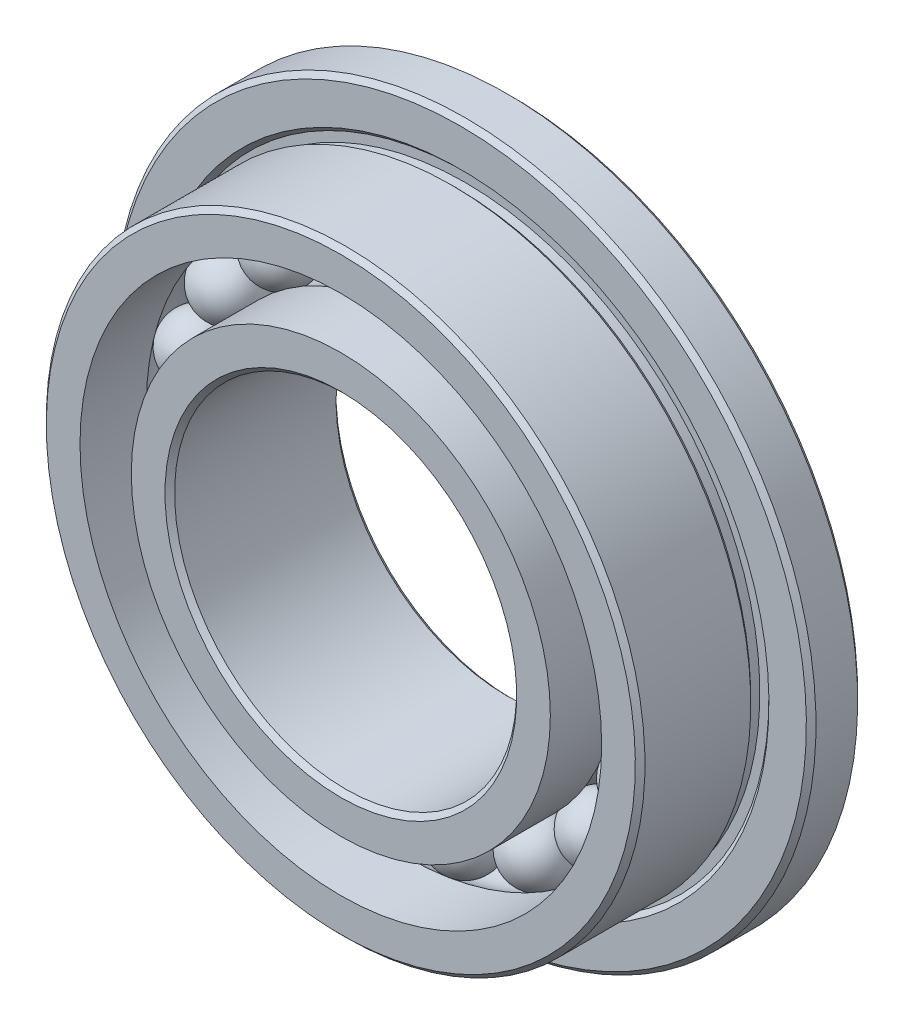
ISO-10303-21;
HEADER;
FILE_DESCRIPTION(('STEP AP214'),'2;1');
FILE_NAME('part.step','',(''),(''),'','','');
FILE_SCHEMA(('AUTOMOTIVE_DESIGN { 1 0 10303 214 1 1 1 1 }'));
ENDSEC;
DATA;
#1=APPLICATION_CONTEXT('core data for automotive mechanical design processes');
#2=APPLICATION_PROTOCOL_DEFINITION('international standard','automotive_design',2000,#1);
#3=PRODUCT_CONTEXT('',#1,'mechanical');
#4=PRODUCT('Part','Part','',(#3));
#5=PRODUCT_RELATED_PRODUCT_CATEGORY('part','',(#4));
#6=PRODUCT_DEFINITION_FORMATION('','',#4);
#7=PRODUCT_DEFINITION_CONTEXT('part definition',#1,'design');
#8=PRODUCT_DEFINITION('design','',#6,#7);
#9=PRODUCT_DEFINITION_SHAPE('','',#8);
#10=(LENGTH_UNIT() NAMED_UNIT(*) SI_UNIT(.MILLI.,.METRE.));
#11=(NAMED_UNIT(*) PLANE_ANGLE_UNIT() SI_UNIT($,.RADIAN.));
#12=(NAMED_UNIT(*) SI_UNIT($,.STERADIAN.) SOLID_ANGLE_UNIT());
#13=UNCERTAINTY_MEASURE_WITH_UNIT(LENGTH_MEASURE(1.E-05),#10,'distance_accuracy_value','');
#14=(GEOMETRIC_REPRESENTATION_CONTEXT(3) GLOBAL_UNCERTAINTY_ASSIGNED_CONTEXT((#13)) GLOBAL_UNIT_ASSIGNED_CONTEXT((#10,
#11,#12)) REPRESENTATION_CONTEXT('',''));
#15=CARTESIAN_POINT('',(0.,0.,0.));
#16=DIRECTION('',(0.,0.,1.));
#17=DIRECTION('',(1.,0.,0.));
#18=AXIS2_PLACEMENT_3D('',#15,#16,#17);
#19=CARTESIAN_POINT('',(-0.892923540312843,2.60099741467676,0.));
#20=DIRECTION('',(-0.324699469204671,0.945817241700639,0.));
#21=DIRECTION('',(0.945817241700639,0.324699469204671,0.));
#22=AXIS2_PLACEMENT_3D('',#19,#20,#21);
#23=SPHERICAL_SURFACE('',#22,0.374999999999999);
#24=CARTESIAN_POINT('',(-1.01468584126459,2.9556788803145,0.));
#25=VERTEX_POINT('',#24);
#26=VERTEX_LOOP('',#25);
#27=FACE_BOUND('',#26,.T.);
#28=ADVANCED_FACE('F52',(#27),#23,.T.);
#29=CLOSED_SHELL('',(#28));
#30=MANIFOLD_SOLID_BREP('B2',#29);
#31=CARTESIAN_POINT('',(-1.68908495989656,2.1701364008401,0.));
#32=DIRECTION('',(-0.614212712689658,0.789140509396402,0.));
#33=DIRECTION('',(0.789140509396402,0.614212712689658,0.));
#34=AXIS2_PLACEMENT_3D('',#31,#32,#33);
#35=SPHERICAL_SURFACE('',#34,0.374999999999999);
#36=CARTESIAN_POINT('',(-1.91941472715518,2.46606409186376,0.));
#37=VERTEX_POINT('',#36);
#38=VERTEX_LOOP('',#37);
#39=FACE_BOUND('',#38,.T.);
#40=ADVANCED_FACE('F71',(#39),#35,.T.);
#41=CLOSED_SHELL('',(#40));
#42=MANIFOLD_SOLID_BREP('B7',#41);
#43=CARTESIAN_POINT('',(-2.30220781522194,1.5041074348367,0.));
#44=DIRECTION('',(-0.837166478262522,0.546948158122437,0.));
#45=DIRECTION('',(0.546948158122437,0.837166478262522,0.));
#46=AXIS2_PLACEMENT_3D('',#43,#44,#45);
#47=SPHERICAL_SURFACE('',#46,0.374999999999999);
#48=CARTESIAN_POINT('',(-2.61614524457038,1.70921299413262,0.));
#49=VERTEX_POINT('',#48);
#50=VERTEX_LOOP('',#49);
#51=FACE_BOUND('',#50,.T.);
#52=ADVANCED_FACE('F90',(#51),#47,.T.);
#53=CLOSED_SHELL('',(#52));
#54=MANIFOLD_SOLID_BREP('B48',#53);
#55=CARTESIAN_POINT('',(-2.66585073133315,0.675085089637227,0.));
#56=DIRECTION('',(-0.969400265939328,0.24548548714081,0.));
#57=DIRECTION('',(0.24548548714081,0.969400265939328,0.));
#58=AXIS2_PLACEMENT_3D('',#55,#56,#57);
#59=SPHERICAL_SURFACE('',#58,0.374999999999999);
#60=CARTESIAN_POINT('',(-3.0293758310604,0.767142147315031,0.));
#61=VERTEX_POINT('',#60);
#62=VERTEX_LOOP('',#61);
#63=FACE_BOUND('',#62,.T.);
#64=ADVANCED_FACE('F109',(#63),#59,.T.);
#65=CLOSED_SHELL('',(#64));
#66=MANIFOLD_SOLID_BREP('B67',#65);
#67=CARTESIAN_POINT('',(-2.74060735576834,-0.227093200048886,0.));
#68=DIRECTION('',(-0.996584493006671,-0.0825793454723223,0.));
#69=DIRECTION('',(-0.0825793454723223,0.996584493006671,0.));
#70=AXIS2_PLACEMENT_3D('',#67,#68,#69);
#71=SPHERICAL_SURFACE('',#70,0.374999999999999);
#72=CARTESIAN_POINT('',(-3.11432654064585,-0.258060454601007,0.));
#73=VERTEX_POINT('',#72);
#74=VERTEX_LOOP('',#73);
#75=FACE_BOUND('',#74,.T.);
#76=ADVANCED_FACE('F128',(#75),#71,.T.);
#77=CLOSED_SHELL('',(#76));
#78=MANIFOLD_SOLID_BREP('B86',#77);
#79=CARTESIAN_POINT('',(-2.51837664830142,-1.10466241779564,0.));
#80=DIRECTION('',(-0.915773326655062,-0.40169542465296,0.));
#81=DIRECTION('',(-0.40169542465296,0.915773326655062,0.));
#82=AXIS2_PLACEMENT_3D('',#79,#80,#81);
#83=SPHERICAL_SURFACE('',#82,0.374999999999999);
#84=CARTESIAN_POINT('',(-2.86179164579707,-1.2552982020405,0.));
#85=VERTEX_POINT('',#84);
#86=VERTEX_LOOP('',#85);
#87=FACE_BOUND('',#86,.T.);
#88=ADVANCED_FACE('F147',(#87),#83,.T.);
#89=CLOSED_SHELL('',(#88));
#90=MANIFOLD_SOLID_BREP('B105',#89);
#91=CARTESIAN_POINT('',(-2.02324075435113,-1.86252432197077,0.));
#92=DIRECTION('',(-0.735723910673138,-0.677281571625734,0.));
#93=DIRECTION('',(-0.677281571625734,0.735723910673138,0.));
#94=AXIS2_PLACEMENT_3D('',#91,#92,#93);
#95=SPHERICAL_SURFACE('',#94,0.374999999999999);
#96=CARTESIAN_POINT('',(-2.29913722085356,-2.11650491133042,0.));
#97=VERTEX_POINT('',#96);
#98=VERTEX_LOOP('',#97);
#99=FACE_BOUND('',#98,.T.);
#100=ADVANCED_FACE('F166',(#99),#95,.T.);
#101=CLOSED_SHELL('',(#100));
#102=MANIFOLD_SOLID_BREP('B124',#101);
#103=CARTESIAN_POINT('',(-1.30885533085197,-2.41855281581783,0.));
#104=DIRECTION('',(-0.475947393037081,-0.879473751206485,0.));
#105=DIRECTION('',(-0.879473751206485,0.475947393037081,0.));
#106=AXIS2_PLACEMENT_3D('',#103,#104,#105);
#107=SPHERICAL_SURFACE('',#106,0.374999999999999);
#108=CARTESIAN_POINT('',(-1.48733560324088,-2.74835547252027,0.));
#109=VERTEX_POINT('',#108);
#110=VERTEX_LOOP('',#109);
#111=FACE_BOUND('',#110,.T.);
#112=ADVANCED_FACE('F185',(#111),#107,.T.);
#113=CLOSED_SHELL('',(#112));
#114=MANIFOLD_SOLID_BREP('B143',#113);
#115=CARTESIAN_POINT('',(-0.452635123272038,-2.71249358435748,0.));
#116=DIRECTION('',(-0.164594590280741,-0.986361303402721,0.));
#117=DIRECTION('',(-0.986361303402721,0.164594590280741,0.));
#118=AXIS2_PLACEMENT_3D('',#115,#116,#117);
#119=SPHERICAL_SURFACE('',#118,0.374999999999999);
#120=CARTESIAN_POINT('',(-0.514358094627316,-3.0823790731335,0.));
#121=VERTEX_POINT('',#120);
#122=VERTEX_LOOP('',#121);
#123=FACE_BOUND('',#122,.T.);
#124=ADVANCED_FACE('F204',(#123),#119,.T.);
#125=CLOSED_SHELL('',(#124));
#126=MANIFOLD_SOLID_BREP('B162',#125);
#127=CARTESIAN_POINT('',(0.452635123271999,-2.71249358435749,0.));
#128=DIRECTION('',(0.164594590280727,-0.986361303402724,0.));
#129=DIRECTION('',(-0.986361303402724,-0.164594590280727,0.));
#130=AXIS2_PLACEMENT_3D('',#127,#128,#129);
#131=SPHERICAL_SURFACE('',#130,0.374999999999999);
#132=CARTESIAN_POINT('',(0.514358094627272,-3.08237907313351,0.));
#133=VERTEX_POINT('',#132);
#134=VERTEX_LOOP('',#133);
#135=FACE_BOUND('',#134,.T.);
#136=ADVANCED_FACE('F223',(#135),#131,.T.);
#137=CLOSED_SHELL('',(#136));
#138=MANIFOLD_SOLID_BREP('B181',#137);
#139=CARTESIAN_POINT('',(1.30885533085194,-2.41855281581785,0.));
#140=DIRECTION('',(0.475947393037068,-0.879473751206492,0.));
#141=DIRECTION('',(-0.879473751206492,-0.475947393037068,0.));
#142=AXIS2_PLACEMENT_3D('',#139,#140,#141);
#143=SPHERICAL_SURFACE('',#142,0.374999999999999);
#144=CARTESIAN_POINT('',(1.48733560324084,-2.74835547252029,0.));
#145=VERTEX_POINT('',#144);
#146=VERTEX_LOOP('',#145);
#147=FACE_BOUND('',#146,.T.);
#148=ADVANCED_FACE('F242',(#147),#143,.T.);
#149=CLOSED_SHELL('',(#148));
#150=MANIFOLD_SOLID_BREP('B200',#149);
#151=CARTESIAN_POINT('',(2.0232407543511,-1.8625243219708,0.));
#152=DIRECTION('',(0.735723910673128,-0.677281571625745,0.));
#153=DIRECTION('',(-0.677281571625745,-0.735723910673128,0.));
#154=AXIS2_PLACEMENT_3D('',#151,#152,#153);
#155=SPHERICAL_SURFACE('',#154,0.374999999999999);
#156=CARTESIAN_POINT('',(2.29913722085353,-2.11650491133045,0.));
#157=VERTEX_POINT('',#156);
#158=VERTEX_LOOP('',#157);
#159=FACE_BOUND('',#158,.T.);
#160=ADVANCED_FACE('F261',(#159),#155,.T.);
#161=CLOSED_SHELL('',(#160));
#162=MANIFOLD_SOLID_BREP('B219',#161);
#163=CARTESIAN_POINT('',(2.5183766483014,-1.10466241779568,0.));
#164=DIRECTION('',(0.915773326655056,-0.401695424652974,0.));
#165=DIRECTION('',(-0.401695424652974,-0.915773326655056,0.));
#166=AXIS2_PLACEMENT_3D('',#163,#164,#165);
#167=SPHERICAL_SURFACE('',#166,0.374999999999999);
#168=CARTESIAN_POINT('',(2.86179164579705,-1.25529820204054,0.));
#169=VERTEX_POINT('',#168);
#170=VERTEX_LOOP('',#169);
#171=FACE_BOUND('',#170,.T.);
#172=ADVANCED_FACE('F280',(#171),#167,.T.);
#173=CLOSED_SHELL('',(#172));
#174=MANIFOLD_SOLID_BREP('B238',#173);
#175=CARTESIAN_POINT('',(2.74060735576834,-0.227093200048924,0.));
#176=DIRECTION('',(0.99658449300667,-0.0825793454723359,0.));
#177=DIRECTION('',(-0.0825793454723359,-0.99658449300667,0.));
#178=AXIS2_PLACEMENT_3D('',#175,#176,#177);
#179=SPHERICAL_SURFACE('',#178,0.374999999999999);
#180=CARTESIAN_POINT('',(3.11432654064584,-0.25806045460105,0.));
#181=VERTEX_POINT('',#180);
#182=VERTEX_LOOP('',#181);
#183=FACE_BOUND('',#182,.T.);
#184=ADVANCED_FACE('F299',(#183),#179,.T.);
#185=CLOSED_SHELL('',(#184));
#186=MANIFOLD_SOLID_BREP('B257',#185);
#187=CARTESIAN_POINT('',(2.66585073133316,0.67508508963719,0.));
#188=DIRECTION('',(0.969400265939331,0.245485487140796,0.));
#189=DIRECTION('',(0.245485487140796,-0.969400265939331,0.));
#190=AXIS2_PLACEMENT_3D('',#187,#188,#189);
#191=SPHERICAL_SURFACE('',#190,0.374999999999999);
#192=CARTESIAN_POINT('',(3.02937583106041,0.767142147314988,0.));
#193=VERTEX_POINT('',#192);
#194=VERTEX_LOOP('',#193);
#195=FACE_BOUND('',#194,.T.);
#196=ADVANCED_FACE('F318',(#195),#191,.T.);
#197=CLOSED_SHELL('',(#196));
#198=MANIFOLD_SOLID_BREP('B276',#197);
#199=CARTESIAN_POINT('',(2.30220781522196,1.50410743483667,0.));
#200=DIRECTION('',(0.83716647826253,0.546948158122425,0.));
#201=DIRECTION('',(0.546948158122425,-0.83716647826253,0.));
#202=AXIS2_PLACEMENT_3D('',#199,#200,#201);
#203=SPHERICAL_SURFACE('',#202,0.374999999999999);
#204=CARTESIAN_POINT('',(2.61614524457041,1.70921299413258,0.));
#205=VERTEX_POINT('',#204);
#206=VERTEX_LOOP('',#205);
#207=FACE_BOUND('',#206,.T.);
#208=ADVANCED_FACE('F337',(#207),#203,.T.);
#209=CLOSED_SHELL('',(#208));
#210=MANIFOLD_SOLID_BREP('B295',#209);
#211=CARTESIAN_POINT('',(1.68908495989659,2.17013640084008,0.));
#212=DIRECTION('',(0.614212712689669,0.789140509396393,0.));
#213=DIRECTION('',(0.789140509396393,-0.614212712689669,0.));
#214=AXIS2_PLACEMENT_3D('',#211,#212,#213);
#215=SPHERICAL_SURFACE('',#214,0.374999999999999);
#216=CARTESIAN_POINT('',(1.91941472715522,2.46606409186373,0.));
#217=VERTEX_POINT('',#216);
#218=VERTEX_LOOP('',#217);
#219=FACE_BOUND('',#218,.T.);
#220=ADVANCED_FACE('F356',(#219),#215,.T.);
#221=CLOSED_SHELL('',(#220));
#222=MANIFOLD_SOLID_BREP('B314',#221);
#223=CARTESIAN_POINT('',(0.892923540312882,2.60099741467674,0.));
#224=DIRECTION('',(0.324699469204684,0.945817241700635,0.));
#225=DIRECTION('',(0.945817241700635,-0.324699469204684,0.));
#226=AXIS2_PLACEMENT_3D('',#223,#224,#225);
#227=SPHERICAL_SURFACE('',#226,0.374999999999999);
#228=CARTESIAN_POINT('',(1.01468584126464,2.95567888031448,0.));
#229=VERTEX_POINT('',#228);
#230=VERTEX_LOOP('',#229);
#231=FACE_BOUND('',#230,.T.);
#232=ADVANCED_FACE('F375',(#231),#227,.T.);
#233=CLOSED_SHELL('',(#232));
#234=MANIFOLD_SOLID_BREP('B333',#233);
#235=CARTESIAN_POINT('',(0.,2.75,0.));
#236=DIRECTION('',(0.,1.,0.));
#237=DIRECTION('',(1.,0.,0.));
#238=AXIS2_PLACEMENT_3D('',#235,#236,#237);
#239=SPHERICAL_SURFACE('',#238,0.374999999999999);
#240=CARTESIAN_POINT('',(0.,3.125,0.));
#241=VERTEX_POINT('',#240);
#242=VERTEX_LOOP('',#241);
#243=FACE_BOUND('',#242,.T.);
#244=ADVANCED_FACE('F397',(#243),#239,.T.);
#245=CLOSED_SHELL('',(#244));
#246=MANIFOLD_SOLID_BREP('B352',#245);
#247=CARTESIAN_POINT('',(0.,0.,0.));
#248=DIRECTION('',(0.,0.,1.));
#249=DIRECTION('',(0.,-1.,0.));
#250=AXIS2_PLACEMENT_3D('',#247,#248,#249);
#251=CYLINDRICAL_SURFACE('',#250,2.45);
#252=CARTESIAN_POINT('',(0.,0.,-0.225));
#253=DIRECTION('',(0.,0.,1.));
#254=DIRECTION('',(0.,-1.,0.));
#255=AXIS2_PLACEMENT_3D('',#252,#253,#254);
#256=CIRCLE('',#255,2.45);
#257=CARTESIAN_POINT('',(0.,-2.45,-0.225));
#258=VERTEX_POINT('',#257);
#259=EDGE_CURVE('E437',#258,#258,#256,.T.);
#260=ORIENTED_EDGE('',*,*,#259,.F.);
#261=EDGE_LOOP('',(#260));
#262=FACE_BOUND('',#261,.T.);
#263=CARTESIAN_POINT('',(0.,0.,-1.));
#264=DIRECTION('',(0.,0.,1.));
#265=DIRECTION('',(0.,-1.,0.));
#266=AXIS2_PLACEMENT_3D('',#263,#264,#265);
#267=CIRCLE('',#266,2.45);
#268=CARTESIAN_POINT('',(0.,-2.45,-1.));
#269=VERTEX_POINT('',#268);
#270=EDGE_CURVE('E446',#269,#269,#267,.T.);
#271=ORIENTED_EDGE('',*,*,#270,.T.);
#272=EDGE_LOOP('',(#271));
#273=FACE_BOUND('',#272,.T.);
#274=ADVANCED_FACE('F417',(#262,#273),#251,.T.);
#275=CARTESIAN_POINT('',(0.,0.,0.));
#276=DIRECTION('',(0.,0.,1.));
#277=DIRECTION('',(0.,-1.,0.));
#278=AXIS2_PLACEMENT_3D('',#275,#276,#277);
#279=TOROIDAL_SURFACE('',#278,2.75,0.375);
#280=CARTESIAN_POINT('',(0.,0.,0.225));
#281=DIRECTION('',(0.,0.,1.));
#282=DIRECTION('',(0.,-1.,0.));
#283=AXIS2_PLACEMENT_3D('',#280,#281,#282);
#284=CIRCLE('',#283,2.45);
#285=CARTESIAN_POINT('',(0.,-2.45,0.225));
#286=VERTEX_POINT('',#285);
#287=EDGE_CURVE('E440',#286,#286,#284,.T.);
#288=ORIENTED_EDGE('',*,*,#287,.F.);
#289=EDGE_LOOP('',(#288));
#290=FACE_BOUND('',#289,.T.);
#291=ORIENTED_EDGE('',*,*,#259,.T.);
#292=EDGE_LOOP('',(#291));
#293=FACE_BOUND('',#292,.T.);
#294=ADVANCED_FACE('F465',(#290,#293),#279,.F.);
#295=CARTESIAN_POINT('',(0.,0.,0.));
#296=DIRECTION('',(0.,0.,1.));
#297=DIRECTION('',(0.,-1.,0.));
#298=AXIS2_PLACEMENT_3D('',#295,#296,#297);
#299=CYLINDRICAL_SURFACE('',#298,2.45);
#300=CARTESIAN_POINT('',(0.,0.,1.));
#301=DIRECTION('',(0.,0.,1.));
#302=DIRECTION('',(0.,-1.,0.));
#303=AXIS2_PLACEMENT_3D('',#300,#301,#302);
#304=CIRCLE('',#303,2.45);
#305=CARTESIAN_POINT('',(0.,-2.45,1.));
#306=VERTEX_POINT('',#305);
#307=EDGE_CURVE('E443',#306,#306,#304,.T.);
#308=ORIENTED_EDGE('',*,*,#307,.F.);
#309=EDGE_LOOP('',(#308));
#310=FACE_BOUND('',#309,.T.);
#311=ORIENTED_EDGE('',*,*,#287,.T.);
#312=EDGE_LOOP('',(#311));
#313=FACE_BOUND('',#312,.T.);
#314=ADVANCED_FACE('F471',(#310,#313),#299,.T.);
#315=CARTESIAN_POINT('',(0.,2.,1.));
#316=DIRECTION('',(0.,0.,-1.));
#317=DIRECTION('',(0.,1.,0.));
#318=AXIS2_PLACEMENT_3D('',#315,#316,#317);
#319=PLANE('',#318);
#320=CARTESIAN_POINT('',(0.,0.,1.));
#321=DIRECTION('',(0.,0.,-1.));
#322=DIRECTION('',(0.,1.,0.));
#323=AXIS2_PLACEMENT_3D('',#320,#321,#322);
#324=CIRCLE('',#323,2.05625);
#325=CARTESIAN_POINT('',(0.,2.05625,1.));
#326=VERTEX_POINT('',#325);
#327=EDGE_CURVE('E396',#326,#326,#324,.T.);
#328=ORIENTED_EDGE('',*,*,#327,.T.);
#329=EDGE_LOOP('',(#328));
#330=FACE_BOUND('',#329,.T.);
#331=ORIENTED_EDGE('',*,*,#307,.T.);
#332=EDGE_LOOP('',(#331));
#333=FACE_BOUND('',#332,.T.);
#334=ADVANCED_FACE('F462',(#330,#333),#319,.F.);
#335=CARTESIAN_POINT('',(0.,0.,0.));
#336=DIRECTION('',(0.,0.,1.));
#337=DIRECTION('',(0.,-1.,0.));
#338=AXIS2_PLACEMENT_3D('',#335,#336,#337);
#339=CYLINDRICAL_SURFACE('',#338,2.);
#340=CARTESIAN_POINT('',(0.,0.,-0.943750000000001));
#341=DIRECTION('',(0.,0.,1.));
#342=DIRECTION('',(0.,-1.,0.));
#343=AXIS2_PLACEMENT_3D('',#340,#341,#342);
#344=CIRCLE('',#343,2.);
#345=CARTESIAN_POINT('',(0.,-2.,-0.943750000000001));
#346=VERTEX_POINT('',#345);
#347=EDGE_CURVE('E424',#346,#346,#344,.F.);
#348=ORIENTED_EDGE('',*,*,#347,.T.);
#349=EDGE_LOOP('',(#348));
#350=FACE_BOUND('',#349,.T.);
#351=CARTESIAN_POINT('',(0.,0.,0.94375));
#352=DIRECTION('',(0.,0.,-1.));
#353=DIRECTION('',(0.,1.,0.));
#354=AXIS2_PLACEMENT_3D('',#351,#352,#353);
#355=CIRCLE('',#354,2.);
#356=CARTESIAN_POINT('',(0.,2.,0.94375));
#357=VERTEX_POINT('',#356);
#358=EDGE_CURVE('E428',#357,#357,#355,.F.);
#359=ORIENTED_EDGE('',*,*,#358,.T.);
#360=EDGE_LOOP('',(#359));
#361=FACE_BOUND('',#360,.T.);
#362=ADVANCED_FACE('F454',(#350,#361),#339,.F.);
#363=CARTESIAN_POINT('',(0.,2.45,-1.));
#364=DIRECTION('',(0.,0.,1.));
#365=DIRECTION('',(0.,-1.,0.));
#366=AXIS2_PLACEMENT_3D('',#363,#364,#365);
#367=PLANE('',#366);
#368=CARTESIAN_POINT('',(0.,0.,-1.));
#369=DIRECTION('',(0.,0.,1.));
#370=DIRECTION('',(0.,-1.,0.));
#371=AXIS2_PLACEMENT_3D('',#368,#369,#370);
#372=CIRCLE('',#371,2.05625);
#373=CARTESIAN_POINT('',(0.,-2.05625,-1.));
#374=VERTEX_POINT('',#373);
#375=EDGE_CURVE('E432',#374,#374,#372,.T.);
#376=ORIENTED_EDGE('',*,*,#375,.T.);
#377=EDGE_LOOP('',(#376));
#378=FACE_BOUND('',#377,.T.);
#379=ORIENTED_EDGE('',*,*,#270,.F.);
#380=EDGE_LOOP('',(#379));
#381=FACE_BOUND('',#380,.T.);
#382=ADVANCED_FACE('F451',(#378,#381),#367,.F.);
#383=CARTESIAN_POINT('',(0.,0.,-1.));
#384=DIRECTION('',(0.,0.,-1.));
#385=DIRECTION('',(0.,1.,0.));
#386=AXIS2_PLACEMENT_3D('',#383,#384,#385);
#387=CONICAL_SURFACE('',#386,2.05625,0.785398163397448);
#388=ORIENTED_EDGE('',*,*,#347,.F.);
#389=EDGE_LOOP('',(#388));
#390=FACE_BOUND('',#389,.T.);
#391=ORIENTED_EDGE('',*,*,#375,.F.);
#392=EDGE_LOOP('',(#391));
#393=FACE_BOUND('',#392,.T.);
#394=ADVANCED_FACE('F453',(#390,#393),#387,.F.);
#395=CARTESIAN_POINT('',(0.,0.,0.94375));
#396=DIRECTION('',(0.,0.,1.));
#397=DIRECTION('',(0.,-1.,0.));
#398=AXIS2_PLACEMENT_3D('',#395,#396,#397);
#399=CONICAL_SURFACE('',#398,2.,0.785398163397446);
#400=ORIENTED_EDGE('',*,*,#327,.F.);
#401=EDGE_LOOP('',(#400));
#402=FACE_BOUND('',#401,.T.);
#403=ORIENTED_EDGE('',*,*,#358,.F.);
#404=EDGE_LOOP('',(#403));
#405=FACE_BOUND('',#404,.T.);
#406=ADVANCED_FACE('F419',(#402,#405),#399,.F.);
#407=CLOSED_SHELL('',(#274,#294,#314,#334,#362,#382,#394,#406));
#408=MANIFOLD_SOLID_BREP('B371',#407);
#409=CARTESIAN_POINT('',(0.,3.05,-1.));
#410=DIRECTION('',(0.,0.,1.));
#411=DIRECTION('',(0.,-1.,0.));
#412=AXIS2_PLACEMENT_3D('',#409,#410,#411);
#413=PLANE('',#412);
#414=CARTESIAN_POINT('',(0.,0.,-1.));
#415=DIRECTION('',(0.,0.,1.));
#416=DIRECTION('',(0.,-1.,0.));
#417=AXIS2_PLACEMENT_3D('',#414,#415,#416);
#418=CIRCLE('',#417,4.04375);
#419=CARTESIAN_POINT('',(0.,-4.04375,-1.));
#420=VERTEX_POINT('',#419);
#421=EDGE_CURVE('E542',#420,#420,#418,.F.);
#422=ORIENTED_EDGE('',*,*,#421,.T.);
#423=EDGE_LOOP('',(#422));
#424=FACE_BOUND('',#423,.T.);
#425=CARTESIAN_POINT('',(0.,0.,-1.));
#426=DIRECTION('',(0.,0.,1.));
#427=DIRECTION('',(0.,-1.,0.));
#428=AXIS2_PLACEMENT_3D('',#425,#426,#427);
#429=CIRCLE('',#428,3.05);
#430=CARTESIAN_POINT('',(0.,-3.05,-1.));
#431=VERTEX_POINT('',#430);
#432=EDGE_CURVE('E556',#431,#431,#429,.T.);
#433=ORIENTED_EDGE('',*,*,#432,.T.);
#434=EDGE_LOOP('',(#433));
#435=FACE_BOUND('',#434,.T.);
#436=ADVANCED_FACE('F524',(#424,#435),#413,.F.);
#437=CARTESIAN_POINT('',(0.,0.,0.));
#438=DIRECTION('',(0.,0.,1.));
#439=DIRECTION('',(0.,-1.,0.));
#440=AXIS2_PLACEMENT_3D('',#437,#438,#439);
#441=CYLINDRICAL_SURFACE('',#440,3.05);
#442=ORIENTED_EDGE('',*,*,#432,.F.);
#443=EDGE_LOOP('',(#442));
#444=FACE_BOUND('',#443,.T.);
#445=CARTESIAN_POINT('',(0.,0.,-0.225));
#446=DIRECTION('',(0.,0.,1.));
#447=DIRECTION('',(0.,-1.,0.));
#448=AXIS2_PLACEMENT_3D('',#445,#446,#447);
#449=CIRCLE('',#448,3.05);
#450=CARTESIAN_POINT('',(0.,-3.05,-0.225));
#451=VERTEX_POINT('',#450);
#452=EDGE_CURVE('E560',#451,#451,#449,.T.);
#453=ORIENTED_EDGE('',*,*,#452,.T.);
#454=EDGE_LOOP('',(#453));
#455=FACE_BOUND('',#454,.T.);
#456=ADVANCED_FACE('F612',(#444,#455),#441,.F.);
#457=CARTESIAN_POINT('',(0.,0.,0.));
#458=DIRECTION('',(0.,0.,1.));
#459=DIRECTION('',(0.,-1.,0.));
#460=AXIS2_PLACEMENT_3D('',#457,#458,#459);
#461=TOROIDAL_SURFACE('',#460,2.75,0.375);
#462=ORIENTED_EDGE('',*,*,#452,.F.);
#463=EDGE_LOOP('',(#462));
#464=FACE_BOUND('',#463,.T.);
#465=CARTESIAN_POINT('',(0.,0.,0.225));
#466=DIRECTION('',(0.,0.,1.));
#467=DIRECTION('',(0.,-1.,0.));
#468=AXIS2_PLACEMENT_3D('',#465,#466,#467);
#469=CIRCLE('',#468,3.05);
#470=CARTESIAN_POINT('',(0.,-3.05,0.225));
#471=VERTEX_POINT('',#470);
#472=EDGE_CURVE('E564',#471,#471,#469,.T.);
#473=ORIENTED_EDGE('',*,*,#472,.T.);
#474=EDGE_LOOP('',(#473));
#475=FACE_BOUND('',#474,.T.);
#476=ADVANCED_FACE('F619',(#464,#475),#461,.F.);
#477=CARTESIAN_POINT('',(0.,0.,0.));
#478=DIRECTION('',(0.,0.,1.));
#479=DIRECTION('',(0.,-1.,0.));
#480=AXIS2_PLACEMENT_3D('',#477,#478,#479);
#481=CYLINDRICAL_SURFACE('',#480,3.05);
#482=ORIENTED_EDGE('',*,*,#472,.F.);
#483=EDGE_LOOP('',(#482));
#484=FACE_BOUND('',#483,.T.);
#485=CARTESIAN_POINT('',(0.,0.,1.));
#486=DIRECTION('',(0.,0.,1.));
#487=DIRECTION('',(0.,-1.,0.));
#488=AXIS2_PLACEMENT_3D('',#485,#486,#487);
#489=CIRCLE('',#488,3.05);
#490=CARTESIAN_POINT('',(0.,-3.05,1.));
#491=VERTEX_POINT('',#490);
#492=EDGE_CURVE('E568',#491,#491,#489,.T.);
#493=ORIENTED_EDGE('',*,*,#492,.T.);
#494=EDGE_LOOP('',(#493));
#495=FACE_BOUND('',#494,.T.);
#496=ADVANCED_FACE('F694',(#484,#495),#481,.F.);
#497=CARTESIAN_POINT('',(0.,3.5,1.));
#498=DIRECTION('',(0.,0.,-1.));
#499=DIRECTION('',(0.,1.,0.));
#500=AXIS2_PLACEMENT_3D('',#497,#498,#499);
#501=PLANE('',#500);
#502=CARTESIAN_POINT('',(0.,0.,1.));
#503=DIRECTION('',(0.,0.,-1.));
#504=DIRECTION('',(0.,1.,0.));
#505=AXIS2_PLACEMENT_3D('',#502,#503,#504);
#506=CIRCLE('',#505,3.44375);
#507=CARTESIAN_POINT('',(0.,3.44375,1.));
#508=VERTEX_POINT('',#507);
#509=EDGE_CURVE('E532',#508,#508,#506,.F.);
#510=ORIENTED_EDGE('',*,*,#509,.T.);
#511=EDGE_LOOP('',(#510));
#512=FACE_BOUND('',#511,.T.);
#513=ORIENTED_EDGE('',*,*,#492,.F.);
#514=EDGE_LOOP('',(#513));
#515=FACE_BOUND('',#514,.T.);
#516=ADVANCED_FACE('F688',(#512,#515),#501,.F.);
#517=CARTESIAN_POINT('',(0.,0.,0.));
#518=DIRECTION('',(0.,0.,1.));
#519=DIRECTION('',(0.,-1.,0.));
#520=AXIS2_PLACEMENT_3D('',#517,#518,#519);
#521=CYLINDRICAL_SURFACE('',#520,3.5);
#522=CARTESIAN_POINT('',(0.,0.,0.94375));
#523=DIRECTION('',(0.,0.,-1.));
#524=DIRECTION('',(0.,1.,0.));
#525=AXIS2_PLACEMENT_3D('',#522,#523,#524);
#526=CIRCLE('',#525,3.5);
#527=CARTESIAN_POINT('',(0.,3.5,0.94375));
#528=VERTEX_POINT('',#527);
#529=EDGE_CURVE('E416',#528,#528,#526,.T.);
#530=ORIENTED_EDGE('',*,*,#529,.T.);
#531=EDGE_LOOP('',(#530));
#532=FACE_BOUND('',#531,.T.);
#533=CARTESIAN_POINT('',(0.,0.,-0.293933982822018));
#534=DIRECTION('',(0.,0.,1.));
#535=DIRECTION('',(0.,-1.,0.));
#536=AXIS2_PLACEMENT_3D('',#533,#534,#535);
#537=CIRCLE('',#536,3.5);
#538=CARTESIAN_POINT('',(0.,-3.5,-0.293933982822018));
#539=VERTEX_POINT('',#538);
#540=EDGE_CURVE('E572',#539,#539,#537,.T.);
#541=ORIENTED_EDGE('',*,*,#540,.T.);
#542=EDGE_LOOP('',(#541));
#543=FACE_BOUND('',#542,.T.);
#544=ADVANCED_FACE('F680',(#532,#543),#521,.T.);
#545=CARTESIAN_POINT('',(0.,0.,-0.34696699141101));
#546=DIRECTION('',(0.,0.,1.));
#547=DIRECTION('',(0.,-1.,0.));
#548=AXIS2_PLACEMENT_3D('',#545,#546,#547);
#549=CONICAL_SURFACE('',#548,3.44696699141101,0.785398163397443);
#550=ORIENTED_EDGE('',*,*,#540,.F.);
#551=EDGE_LOOP('',(#550));
#552=FACE_BOUND('',#551,.T.);
#553=CARTESIAN_POINT('',(0.,0.,-0.34696699141101));
#554=DIRECTION('',(0.,0.,1.));
#555=DIRECTION('',(0.,-1.,0.));
#556=AXIS2_PLACEMENT_3D('',#553,#554,#555);
#557=CIRCLE('',#556,3.44696699141101);
#558=CARTESIAN_POINT('',(0.,-3.44696699141101,-0.34696699141101));
#559=VERTEX_POINT('',#558);
#560=EDGE_CURVE('E576',#559,#559,#557,.T.);
#561=ORIENTED_EDGE('',*,*,#560,.T.);
#562=EDGE_LOOP('',(#561));
#563=FACE_BOUND('',#562,.T.);
#564=ADVANCED_FACE('F672',(#552,#563),#549,.T.);
#565=CARTESIAN_POINT('',(0.,0.,0.));
#566=DIRECTION('',(0.,0.,1.));
#567=DIRECTION('',(0.,-1.,0.));
#568=AXIS2_PLACEMENT_3D('',#565,#566,#567);
#569=CYLINDRICAL_SURFACE('',#568,3.44696699141101);
#570=ORIENTED_EDGE('',*,*,#560,.F.);
#571=EDGE_LOOP('',(#570));
#572=FACE_BOUND('',#571,.T.);
#573=CARTESIAN_POINT('',(0.,0.,-0.453033008588992));
#574=DIRECTION('',(0.,0.,1.));
#575=DIRECTION('',(0.,-1.,0.));
#576=AXIS2_PLACEMENT_3D('',#573,#574,#575);
#577=CIRCLE('',#576,3.44696699141101);
#578=CARTESIAN_POINT('',(0.,-3.44696699141101,-0.453033008588993));
#579=VERTEX_POINT('',#578);
#580=EDGE_CURVE('E580',#579,#579,#577,.T.);
#581=ORIENTED_EDGE('',*,*,#580,.T.);
#582=EDGE_LOOP('',(#581));
#583=FACE_BOUND('',#582,.T.);
#584=ADVANCED_FACE('F664',(#572,#583),#569,.T.);
#585=CARTESIAN_POINT('',(0.,3.55303300858899,-0.453033008588992));
#586=DIRECTION('',(0.,0.,-1.));
#587=DIRECTION('',(0.,1.,0.));
#588=AXIS2_PLACEMENT_3D('',#585,#586,#587);
#589=PLANE('',#588);
#590=ORIENTED_EDGE('',*,*,#580,.F.);
#591=EDGE_LOOP('',(#590));
#592=FACE_BOUND('',#591,.T.);
#593=CARTESIAN_POINT('',(0.,0.,-0.453033008588992));
#594=DIRECTION('',(0.,0.,1.));
#595=DIRECTION('',(0.,-1.,0.));
#596=AXIS2_PLACEMENT_3D('',#593,#594,#595);
#597=CIRCLE('',#596,3.55303300858899);
#598=CARTESIAN_POINT('',(0.,-3.55303300858899,-0.453033008588992));
#599=VERTEX_POINT('',#598);
#600=EDGE_CURVE('E584',#599,#599,#597,.T.);
#601=ORIENTED_EDGE('',*,*,#600,.T.);
#602=EDGE_LOOP('',(#601));
#603=FACE_BOUND('',#602,.T.);
#604=ADVANCED_FACE('F608',(#592,#603),#589,.F.);
#605=CARTESIAN_POINT('',(0.,0.,-0.400000000000001));
#606=DIRECTION('',(0.,0.,1.));
#607=DIRECTION('',(0.,-1.,0.));
#608=AXIS2_PLACEMENT_3D('',#605,#606,#607);
#609=CONICAL_SURFACE('',#608,3.60606601717798,0.78539816339744);
#610=ORIENTED_EDGE('',*,*,#600,.F.);
#611=EDGE_LOOP('',(#610));
#612=FACE_BOUND('',#611,.T.);
#613=CARTESIAN_POINT('',(0.,0.,-0.400000000000001));
#614=DIRECTION('',(0.,0.,1.));
#615=DIRECTION('',(0.,-1.,0.));
#616=AXIS2_PLACEMENT_3D('',#613,#614,#615);
#617=CIRCLE('',#616,3.60606601717798);
#618=CARTESIAN_POINT('',(0.,-3.60606601717798,-0.400000000000001));
#619=VERTEX_POINT('',#618);
#620=EDGE_CURVE('E588',#619,#619,#617,.T.);
#621=ORIENTED_EDGE('',*,*,#620,.T.);
#622=EDGE_LOOP('',(#621));
#623=FACE_BOUND('',#622,.T.);
#624=ADVANCED_FACE('F593',(#612,#623),#609,.F.);
#625=CARTESIAN_POINT('',(0.,4.1,-0.400000000000001));
#626=DIRECTION('',(0.,0.,-1.));
#627=DIRECTION('',(0.,1.,0.));
#628=AXIS2_PLACEMENT_3D('',#625,#626,#627);
#629=PLANE('',#628);
#630=CARTESIAN_POINT('',(0.,0.,-0.400000000000001));
#631=DIRECTION('',(0.,0.,-1.));
#632=DIRECTION('',(0.,1.,0.));
#633=AXIS2_PLACEMENT_3D('',#630,#631,#632);
#634=CIRCLE('',#633,4.04375);
#635=CARTESIAN_POINT('',(0.,4.04375,-0.400000000000001));
#636=VERTEX_POINT('',#635);
#637=EDGE_CURVE('E537',#636,#636,#634,.F.);
#638=ORIENTED_EDGE('',*,*,#637,.T.);
#639=EDGE_LOOP('',(#638));
#640=FACE_BOUND('',#639,.T.);
#641=ORIENTED_EDGE('',*,*,#620,.F.);
#642=EDGE_LOOP('',(#641));
#643=FACE_BOUND('',#642,.T.);
#644=ADVANCED_FACE('F595',(#640,#643),#629,.F.);
#645=CARTESIAN_POINT('',(0.,0.,0.));
#646=DIRECTION('',(0.,0.,1.));
#647=DIRECTION('',(0.,-1.,0.));
#648=AXIS2_PLACEMENT_3D('',#645,#646,#647);
#649=CYLINDRICAL_SURFACE('',#648,4.1);
#650=CARTESIAN_POINT('',(0.,0.,-0.943750000000001));
#651=DIRECTION('',(0.,0.,1.));
#652=DIRECTION('',(0.,-1.,0.));
#653=AXIS2_PLACEMENT_3D('',#650,#651,#652);
#654=CIRCLE('',#653,4.1);
#655=CARTESIAN_POINT('',(0.,-4.1,-0.943750000000001));
#656=VERTEX_POINT('',#655);
#657=EDGE_CURVE('E548',#656,#656,#654,.T.);
#658=ORIENTED_EDGE('',*,*,#657,.T.);
#659=EDGE_LOOP('',(#658));
#660=FACE_BOUND('',#659,.T.);
#661=CARTESIAN_POINT('',(0.,0.,-0.456250000000001));
#662=DIRECTION('',(0.,0.,-1.));
#663=DIRECTION('',(0.,1.,0.));
#664=AXIS2_PLACEMENT_3D('',#661,#662,#663);
#665=CIRCLE('',#664,4.1);
#666=CARTESIAN_POINT('',(0.,4.1,-0.456250000000001));
#667=VERTEX_POINT('',#666);
#668=EDGE_CURVE('E552',#667,#667,#665,.T.);
#669=ORIENTED_EDGE('',*,*,#668,.T.);
#670=EDGE_LOOP('',(#669));
#671=FACE_BOUND('',#670,.T.);
#672=ADVANCED_FACE('F597',(#660,#671),#649,.T.);
#673=CARTESIAN_POINT('',(0.,0.,-0.943750000000001));
#674=DIRECTION('',(0.,0.,1.));
#675=DIRECTION('',(0.,-1.,0.));
#676=AXIS2_PLACEMENT_3D('',#673,#674,#675);
#677=CONICAL_SURFACE('',#676,4.1,0.785398163397448);
#678=ORIENTED_EDGE('',*,*,#421,.F.);
#679=EDGE_LOOP('',(#678));
#680=FACE_BOUND('',#679,.T.);
#681=ORIENTED_EDGE('',*,*,#657,.F.);
#682=EDGE_LOOP('',(#681));
#683=FACE_BOUND('',#682,.T.);
#684=ADVANCED_FACE('F604',(#680,#683),#677,.T.);
#685=CARTESIAN_POINT('',(0.,0.,-0.400000000000001));
#686=DIRECTION('',(0.,0.,-1.));
#687=DIRECTION('',(0.,1.,0.));
#688=AXIS2_PLACEMENT_3D('',#685,#686,#687);
#689=CONICAL_SURFACE('',#688,4.04375,0.785398163397447);
#690=CARTESIAN_POINT('',(0.,4.1,-0.456250000000001));
#691=CARTESIAN_POINT('',(0.,4.0994140625,-0.455664062500001));
#692=CARTESIAN_POINT('',(0.,4.098828125,-0.455078125000001));
#693=CARTESIAN_POINT('',(0.,4.09765625,-0.453906250000001));
#694=CARTESIAN_POINT('',(0.,4.0970703125,-0.453320312500001));
#695=CARTESIAN_POINT('',(0.,4.0958984375,-0.452148437500001));
#696=CARTESIAN_POINT('',(0.,4.0953125,-0.451562500000001));
#697=CARTESIAN_POINT('',(0.,4.094140625,-0.450390625000001));
#698=CARTESIAN_POINT('',(0.,4.0935546875,-0.449804687500001));
#699=CARTESIAN_POINT('',(0.,4.0923828125,-0.448632812500001));
#700=CARTESIAN_POINT('',(0.,4.091796875,-0.448046875000001));
#701=CARTESIAN_POINT('',(0.,4.090625,-0.446875000000001));
#702=CARTESIAN_POINT('',(0.,4.0900390625,-0.446289062500001));
#703=CARTESIAN_POINT('',(0.,4.0888671875,-0.445117187500001));
#704=CARTESIAN_POINT('',(0.,4.08828125,-0.444531250000001));
#705=CARTESIAN_POINT('',(0.,4.087109375,-0.443359375000001));
#706=CARTESIAN_POINT('',(0.,4.0865234375,-0.442773437500001));
#707=CARTESIAN_POINT('',(0.,4.0853515625,-0.441601562500001));
#708=CARTESIAN_POINT('',(0.,4.084765625,-0.441015625000001));
#709=CARTESIAN_POINT('',(0.,4.08359375,-0.439843750000001));
#710=CARTESIAN_POINT('',(0.,4.0830078125,-0.439257812500001));
#711=CARTESIAN_POINT('',(0.,4.0818359375,-0.438085937500001));
#712=CARTESIAN_POINT('',(0.,4.08125,-0.437500000000001));
#713=CARTESIAN_POINT('',(0.,4.080078125,-0.436328125000001));
#714=CARTESIAN_POINT('',(0.,4.0794921875,-0.435742187500001));
#715=CARTESIAN_POINT('',(0.,4.0783203125,-0.434570312500001));
#716=CARTESIAN_POINT('',(0.,4.077734375,-0.433984375000001));
#717=CARTESIAN_POINT('',(0.,4.0765625,-0.432812500000001));
#718=CARTESIAN_POINT('',(0.,4.0759765625,-0.432226562500001));
#719=CARTESIAN_POINT('',(0.,4.0748046875,-0.431054687500001));
#720=CARTESIAN_POINT('',(0.,4.07421875,-0.430468750000001));
#721=CARTESIAN_POINT('',(0.,4.073046875,-0.429296875000001));
#722=CARTESIAN_POINT('',(0.,4.0724609375,-0.428710937500001));
#723=CARTESIAN_POINT('',(0.,4.0712890625,-0.427539062500001));
#724=CARTESIAN_POINT('',(0.,4.070703125,-0.426953125000001));
#725=CARTESIAN_POINT('',(0.,4.06953125,-0.425781250000001));
#726=CARTESIAN_POINT('',(0.,4.0689453125,-0.425195312500001));
#727=CARTESIAN_POINT('',(0.,4.0677734375,-0.424023437500001));
#728=CARTESIAN_POINT('',(0.,4.0671875,-0.423437500000001));
#729=CARTESIAN_POINT('',(0.,4.066015625,-0.422265625000001));
#730=CARTESIAN_POINT('',(0.,4.0654296875,-0.421679687500001));
#731=CARTESIAN_POINT('',(0.,4.0642578125,-0.420507812500001));
#732=CARTESIAN_POINT('',(0.,4.063671875,-0.419921875000001));
#733=CARTESIAN_POINT('',(0.,4.0625,-0.418750000000001));
#734=CARTESIAN_POINT('',(0.,4.0619140625,-0.418164062500001));
#735=CARTESIAN_POINT('',(0.,4.0607421875,-0.416992187500001));
#736=CARTESIAN_POINT('',(0.,4.06015625,-0.416406250000001));
#737=CARTESIAN_POINT('',(0.,4.058984375,-0.415234375000001));
#738=CARTESIAN_POINT('',(0.,4.0583984375,-0.414648437500001));
#739=CARTESIAN_POINT('',(0.,4.0572265625,-0.413476562500001));
#740=CARTESIAN_POINT('',(0.,4.056640625,-0.412890625000001));
#741=CARTESIAN_POINT('',(0.,4.05546875,-0.411718750000001));
#742=CARTESIAN_POINT('',(0.,4.0548828125,-0.411132812500001));
#743=CARTESIAN_POINT('',(0.,4.0537109375,-0.409960937500001));
#744=CARTESIAN_POINT('',(0.,4.053125,-0.409375000000001));
#745=CARTESIAN_POINT('',(0.,4.051953125,-0.408203125000001));
#746=CARTESIAN_POINT('',(0.,4.0513671875,-0.407617187500001));
#747=CARTESIAN_POINT('',(0.,4.0501953125,-0.406445312500001));
#748=CARTESIAN_POINT('',(0.,4.049609375,-0.405859375000001));
#749=CARTESIAN_POINT('',(0.,4.0484375,-0.404687500000001));
#750=CARTESIAN_POINT('',(0.,4.0478515625,-0.404101562500001));
#751=CARTESIAN_POINT('',(0.,4.0466796875,-0.402929687500001));
#752=CARTESIAN_POINT('',(0.,4.04609375,-0.402343750000001));
#753=CARTESIAN_POINT('',(0.,4.044921875,-0.401171875000001));
#754=CARTESIAN_POINT('',(0.,4.0443359375,-0.400585937500001));
#755=CARTESIAN_POINT('',(0.,4.04375,-0.400000000000001));
#756=B_SPLINE_CURVE_WITH_KNOTS('',3,(#690,#691,#692,#693,#694,#695,#696,#697,#698,#699,#700,
#701,#702,#703,#704,#705,#706,#707,#708,#709,#710,#711,#712,#713,#714,#715,#716,#717,#718,#719,
#720,#721,#722,#723,#724,#725,#726,#727,#728,#729,#730,#731,#732,#733,#734,#735,#736,#737,#738,
#739,#740,#741,#742,#743,#744,#745,#746,#747,#748,#749,#750,#751,#752,#753,#754,#755),
.UNSPECIFIED.,.F.,.F.,(4,2,2,2,2,2,2,2,2,2,2,2,2,2,2,2,2,2,2,2,2,2,2,2,2,2,2,2,2,2,2,2,4),(0.,
0.00248592227760914,0.00497184455521763,0.00745776683282678,0.00994368911043592,
0.012429611388045,0.0149155336656536,0.0174014559432627,0.0198873782208718,0.0223733004984803,
0.0248592227760894,0.0273451450536986,0.0298310673313077,0.0323169896089162,0.0348029118865253,
0.0372888341641345,0.0397747564417436,0.0422606787193521,0.0447466009969612,0.0472325232745703,
0.0497184455521789,0.052204367829788,0.0546902901073971,0.0571762123850062,0.0596621346626147,
0.0621480569402239,0.064633979217833,0.0671199014954415,0.0696058237730506,0.0720917460506598,
0.0745776683282689,0.0770635906058774,0.0795495128834865),.UNSPECIFIED.);
#757=EDGE_CURVE('BSEAM626',#667,#636,#756,.T.);
#758=ORIENTED_EDGE('',*,*,#668,.F.);
#759=ORIENTED_EDGE('',*,*,#637,.F.);
#760=ORIENTED_EDGE('',*,*,#757,.T.);
#761=ORIENTED_EDGE('',*,*,#757,.F.);
#762=EDGE_LOOP('',(#758,#760,#759,#761));
#763=FACE_BOUND('',#762,.T.);
#764=ADVANCED_FACE('F626',(#763),#689,.T.);
#765=CARTESIAN_POINT('',(0.,0.,1.));
#766=DIRECTION('',(0.,0.,-1.));
#767=DIRECTION('',(0.,1.,0.));
#768=AXIS2_PLACEMENT_3D('',#765,#766,#767);
#769=CONICAL_SURFACE('',#768,3.44375,0.785398163397446);
#770=ORIENTED_EDGE('',*,*,#529,.F.);
#771=EDGE_LOOP('',(#770));
#772=FACE_BOUND('',#771,.T.);
#773=ORIENTED_EDGE('',*,*,#509,.F.);
#774=EDGE_LOOP('',(#773));
#775=FACE_BOUND('',#774,.T.);
#776=ADVANCED_FACE('F526',(#772,#775),#769,.T.);
#777=CLOSED_SHELL('',(#436,#456,#476,#496,#516,#544,#564,#584,#604,#624,#644,#672,#684,#764,#776));
#778=MANIFOLD_SOLID_BREP('B391',#777);
#779=ADVANCED_BREP_SHAPE_REPRESENTATION('',(#18,#30,#42,#54,#66,#78,#90,#102,#114,#126,#138,
#150,#162,#174,#186,#198,#210,#222,#234,#246,#408,#778),#14);
#780=SHAPE_DEFINITION_REPRESENTATION(#9,#779);
ENDSEC;
END-ISO-10303-21;
